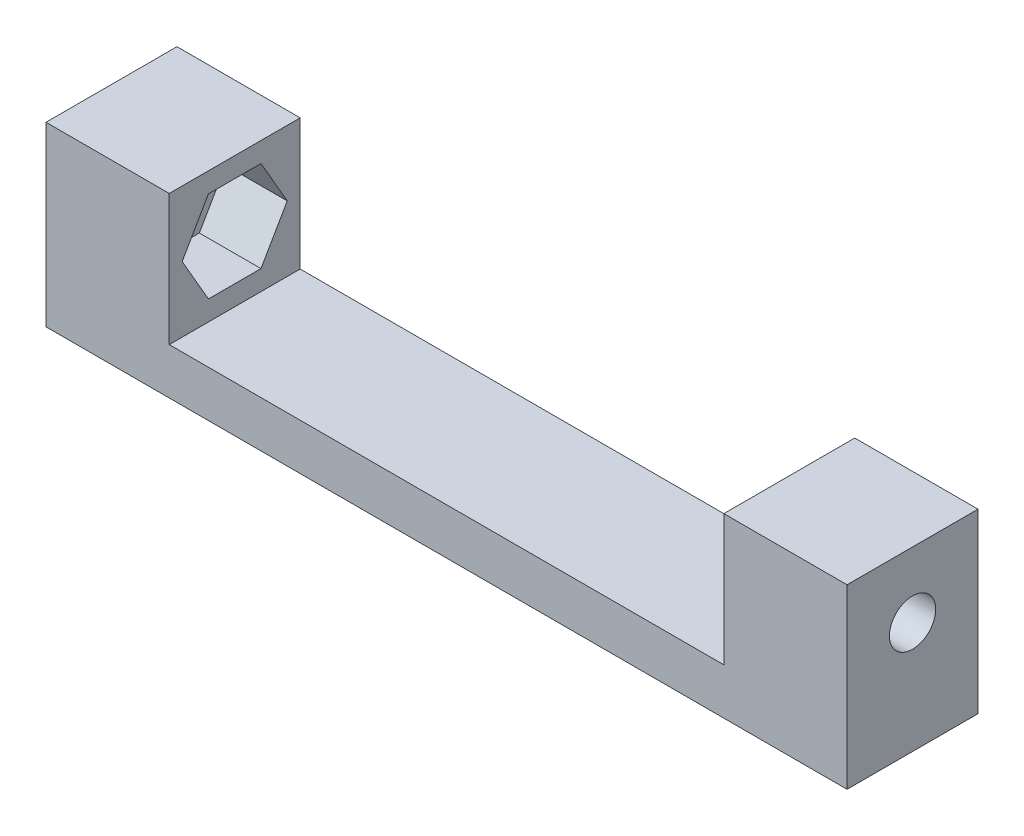
ISO-10303-21;
HEADER;
FILE_DESCRIPTION(('STEP AP214'),'2;1');
FILE_NAME('part.step','',(''),(''),'','','');
FILE_SCHEMA(('AUTOMOTIVE_DESIGN { 1 0 10303 214 1 1 1 1 }'));
ENDSEC;
DATA;
#1=APPLICATION_CONTEXT('core data for automotive mechanical design processes');
#2=APPLICATION_PROTOCOL_DEFINITION('international standard','automotive_design',2000,#1);
#3=PRODUCT_CONTEXT('',#1,'mechanical');
#4=PRODUCT('Part','Part','',(#3));
#5=PRODUCT_RELATED_PRODUCT_CATEGORY('part','',(#4));
#6=PRODUCT_DEFINITION_FORMATION('','',#4);
#7=PRODUCT_DEFINITION_CONTEXT('part definition',#1,'design');
#8=PRODUCT_DEFINITION('design','',#6,#7);
#9=PRODUCT_DEFINITION_SHAPE('','',#8);
#10=(LENGTH_UNIT() NAMED_UNIT(*) SI_UNIT(.MILLI.,.METRE.));
#11=(NAMED_UNIT(*) PLANE_ANGLE_UNIT() SI_UNIT($,.RADIAN.));
#12=(NAMED_UNIT(*) SI_UNIT($,.STERADIAN.) SOLID_ANGLE_UNIT());
#13=UNCERTAINTY_MEASURE_WITH_UNIT(LENGTH_MEASURE(1.E-05),#10,'distance_accuracy_value','');
#14=(GEOMETRIC_REPRESENTATION_CONTEXT(3) GLOBAL_UNCERTAINTY_ASSIGNED_CONTEXT((#13)) GLOBAL_UNIT_ASSIGNED_CONTEXT((#10,
#11,#12)) REPRESENTATION_CONTEXT('',''));
#15=CARTESIAN_POINT('',(0.,0.,0.));
#16=DIRECTION('',(0.,0.,1.));
#17=DIRECTION('',(1.,0.,0.));
#18=AXIS2_PLACEMENT_3D('',#15,#16,#17);
#19=CARTESIAN_POINT('',(53.,0.,0.));
#20=DIRECTION('',(-1.,0.,0.));
#21=DIRECTION('',(0.,0.,1.));
#22=AXIS2_PLACEMENT_3D('',#19,#20,#21);
#23=CYLINDRICAL_SURFACE('',#22,1.5);
#24=CARTESIAN_POINT('',(50.,0.,0.));
#25=DIRECTION('',(-1.,0.,0.));
#26=DIRECTION('',(0.,0.,1.));
#27=AXIS2_PLACEMENT_3D('',#24,#25,#26);
#28=CIRCLE('',#27,1.5);
#29=CARTESIAN_POINT('',(50.,0.,1.5));
#30=VERTEX_POINT('',#29);
#31=EDGE_CURVE('E322',#30,#30,#28,.T.);
#32=ORIENTED_EDGE('',*,*,#31,.F.);
#33=EDGE_LOOP('',(#32));
#34=FACE_BOUND('',#33,.T.);
#35=CARTESIAN_POINT('',(46.,0.,0.));
#36=DIRECTION('',(-1.,0.,0.));
#37=DIRECTION('',(0.,0.,1.));
#38=AXIS2_PLACEMENT_3D('',#35,#36,#37);
#39=CIRCLE('',#38,1.5);
#40=CARTESIAN_POINT('',(46.,0.,1.5));
#41=VERTEX_POINT('',#40);
#42=EDGE_CURVE('E46',#41,#41,#39,.F.);
#43=ORIENTED_EDGE('',*,*,#42,.F.);
#44=EDGE_LOOP('',(#43));
#45=FACE_BOUND('',#44,.T.);
#46=ADVANCED_FACE('F42',(#34,#45),#23,.F.);
#47=CARTESIAN_POINT('',(-2.,0.,0.));
#48=DIRECTION('',(1.,0.,0.));
#49=DIRECTION('',(0.,0.,-1.));
#50=AXIS2_PLACEMENT_3D('',#47,#48,#49);
#51=CYLINDRICAL_SURFACE('',#50,1.5);
#52=CARTESIAN_POINT('',(-2.,0.,0.));
#53=DIRECTION('',(1.,0.,0.));
#54=DIRECTION('',(0.,0.,-1.));
#55=AXIS2_PLACEMENT_3D('',#52,#53,#54);
#56=CIRCLE('',#55,1.5);
#57=CARTESIAN_POINT('',(-2.,0.,-1.5));
#58=VERTEX_POINT('',#57);
#59=EDGE_CURVE('E372',#58,#58,#56,.T.);
#60=ORIENTED_EDGE('',*,*,#59,.F.);
#61=EDGE_LOOP('',(#60));
#62=FACE_BOUND('',#61,.T.);
#63=CARTESIAN_POINT('',(2.,0.,0.));
#64=DIRECTION('',(1.,0.,0.));
#65=DIRECTION('',(0.,0.,-1.));
#66=AXIS2_PLACEMENT_3D('',#63,#64,#65);
#67=CIRCLE('',#66,1.5);
#68=CARTESIAN_POINT('',(2.,0.,-1.5));
#69=VERTEX_POINT('',#68);
#70=EDGE_CURVE('E247',#69,#69,#67,.F.);
#71=ORIENTED_EDGE('',*,*,#70,.F.);
#72=EDGE_LOOP('',(#71));
#73=FACE_BOUND('',#72,.T.);
#74=ADVANCED_FACE('F415',(#62,#73),#51,.F.);
#75=CARTESIAN_POINT('',(0.,-4.25,0.));
#76=DIRECTION('',(0.,-1.,0.));
#77=DIRECTION('',(0.,0.,-1.));
#78=AXIS2_PLACEMENT_3D('',#75,#76,#77);
#79=PLANE('',#78);
#80=DIRECTION('',(-1.,0.,0.));
#81=VECTOR('',#80,1.);
#82=CARTESIAN_POINT('',(-2.,-4.25,4.25));
#83=LINE('',#82,#81);
#84=CARTESIAN_POINT('',(42.,-4.25,4.25));
#85=VERTEX_POINT('',#84);
#86=CARTESIAN_POINT('',(6.,-4.25,4.25));
#87=VERTEX_POINT('',#86);
#88=EDGE_CURVE('E65',#85,#87,#83,.T.);
#89=ORIENTED_EDGE('',*,*,#88,.F.);
#90=DIRECTION('',(0.,0.,1.));
#91=VECTOR('',#90,1.);
#92=CARTESIAN_POINT('',(42.,-4.25,-4.25));
#93=LINE('',#92,#91);
#94=CARTESIAN_POINT('',(42.,-4.25,-4.25));
#95=VERTEX_POINT('',#94);
#96=EDGE_CURVE('E60',#95,#85,#93,.T.);
#97=ORIENTED_EDGE('',*,*,#96,.F.);
#98=DIRECTION('',(1.,0.,0.));
#99=VECTOR('',#98,1.);
#100=CARTESIAN_POINT('',(-2.,-4.25,-4.25));
#101=LINE('',#100,#99);
#102=CARTESIAN_POINT('',(6.,-4.25,-4.25));
#103=VERTEX_POINT('',#102);
#104=EDGE_CURVE('E345',#103,#95,#101,.T.);
#105=ORIENTED_EDGE('',*,*,#104,.F.);
#106=DIRECTION('',(0.,0.,-1.));
#107=VECTOR('',#106,1.);
#108=CARTESIAN_POINT('',(6.,-4.25,4.25));
#109=LINE('',#108,#107);
#110=EDGE_CURVE('E311',#87,#103,#109,.T.);
#111=ORIENTED_EDGE('',*,*,#110,.F.);
#112=EDGE_LOOP('',(#89,#97,#105,#111));
#113=FACE_BOUND('',#112,.T.);
#114=ADVANCED_FACE('F417',(#113),#79,.F.);
#115=CARTESIAN_POINT('',(5.,-4.25,-4.25));
#116=DIRECTION('',(0.,0.,1.));
#117=DIRECTION('',(1.,0.,0.));
#118=AXIS2_PLACEMENT_3D('',#115,#116,#117);
#119=PLANE('',#118);
#120=DIRECTION('',(-1.,0.,0.));
#121=VECTOR('',#120,1.);
#122=CARTESIAN_POINT('',(5.,4.25,-4.25));
#123=LINE('',#122,#121);
#124=CARTESIAN_POINT('',(6.,4.25,-4.25));
#125=VERTEX_POINT('',#124);
#126=CARTESIAN_POINT('',(-2.,4.25,-4.25));
#127=VERTEX_POINT('',#126);
#128=EDGE_CURVE('E11',#125,#127,#123,.T.);
#129=ORIENTED_EDGE('',*,*,#128,.F.);
#130=DIRECTION('',(0.,1.,0.));
#131=VECTOR('',#130,1.);
#132=CARTESIAN_POINT('',(6.,4.25,-4.25));
#133=LINE('',#132,#131);
#134=EDGE_CURVE('E314',#103,#125,#133,.T.);
#135=ORIENTED_EDGE('',*,*,#134,.F.);
#136=ORIENTED_EDGE('',*,*,#104,.T.);
#137=DIRECTION('',(0.,-1.,0.));
#138=VECTOR('',#137,1.);
#139=CARTESIAN_POINT('',(42.,4.25,-4.25));
#140=LINE('',#139,#138);
#141=CARTESIAN_POINT('',(42.,4.25,-4.25));
#142=VERTEX_POINT('',#141);
#143=EDGE_CURVE('E269',#142,#95,#140,.T.);
#144=ORIENTED_EDGE('',*,*,#143,.F.);
#145=DIRECTION('',(1.,0.,0.));
#146=VECTOR('',#145,1.);
#147=CARTESIAN_POINT('',(50.,4.25,-4.25));
#148=LINE('',#147,#146);
#149=CARTESIAN_POINT('',(50.,4.25,-4.25));
#150=VERTEX_POINT('',#149);
#151=EDGE_CURVE('E337',#142,#150,#148,.T.);
#152=ORIENTED_EDGE('',*,*,#151,.T.);
#153=DIRECTION('',(0.,1.,0.));
#154=VECTOR('',#153,1.);
#155=CARTESIAN_POINT('',(50.,-7.25,-4.25));
#156=LINE('',#155,#154);
#157=CARTESIAN_POINT('',(50.,-7.25,-4.25));
#158=VERTEX_POINT('',#157);
#159=EDGE_CURVE('E369',#158,#150,#156,.T.);
#160=ORIENTED_EDGE('',*,*,#159,.F.);
#161=DIRECTION('',(1.,0.,0.));
#162=VECTOR('',#161,1.);
#163=CARTESIAN_POINT('',(-2.,-7.25,-4.25));
#164=LINE('',#163,#162);
#165=CARTESIAN_POINT('',(-2.,-7.25,-4.25));
#166=VERTEX_POINT('',#165);
#167=EDGE_CURVE('E352',#166,#158,#164,.T.);
#168=ORIENTED_EDGE('',*,*,#167,.F.);
#169=DIRECTION('',(0.,-1.,0.));
#170=VECTOR('',#169,1.);
#171=CARTESIAN_POINT('',(-2.,-4.25,-4.25));
#172=LINE('',#171,#170);
#173=EDGE_CURVE('E384',#127,#166,#172,.T.);
#174=ORIENTED_EDGE('',*,*,#173,.F.);
#175=EDGE_LOOP('',(#129,#135,#136,#144,#152,#160,#168,#174));
#176=FACE_BOUND('',#175,.T.);
#177=ADVANCED_FACE('F44',(#176),#119,.F.);
#178=CARTESIAN_POINT('',(5.,4.25,4.25));
#179=DIRECTION('',(0.,-1.,0.));
#180=DIRECTION('',(0.,0.,-1.));
#181=AXIS2_PLACEMENT_3D('',#178,#179,#180);
#182=PLANE('',#181);
#183=ORIENTED_EDGE('',*,*,#128,.T.);
#184=DIRECTION('',(0.,0.,-1.));
#185=VECTOR('',#184,1.);
#186=CARTESIAN_POINT('',(-2.,4.25,-4.25));
#187=LINE('',#186,#185);
#188=CARTESIAN_POINT('',(-2.,4.25,4.25));
#189=VERTEX_POINT('',#188);
#190=EDGE_CURVE('E380',#189,#127,#187,.T.);
#191=ORIENTED_EDGE('',*,*,#190,.F.);
#192=DIRECTION('',(-1.,0.,0.));
#193=VECTOR('',#192,1.);
#194=CARTESIAN_POINT('',(5.,4.25,4.25));
#195=LINE('',#194,#193);
#196=CARTESIAN_POINT('',(6.,4.25,4.25));
#197=VERTEX_POINT('',#196);
#198=EDGE_CURVE('E52',#197,#189,#195,.T.);
#199=ORIENTED_EDGE('',*,*,#198,.F.);
#200=DIRECTION('',(0.,0.,1.));
#201=VECTOR('',#200,1.);
#202=CARTESIAN_POINT('',(6.,4.25,4.25));
#203=LINE('',#202,#201);
#204=EDGE_CURVE('E318',#125,#197,#203,.T.);
#205=ORIENTED_EDGE('',*,*,#204,.F.);
#206=EDGE_LOOP('',(#183,#191,#199,#205));
#207=FACE_BOUND('',#206,.T.);
#208=ADVANCED_FACE('F463',(#207),#182,.F.);
#209=CARTESIAN_POINT('',(5.,-4.25,4.25));
#210=DIRECTION('',(0.,0.,-1.));
#211=DIRECTION('',(-1.,0.,0.));
#212=AXIS2_PLACEMENT_3D('',#209,#210,#211);
#213=PLANE('',#212);
#214=DIRECTION('',(0.,1.,0.));
#215=VECTOR('',#214,1.);
#216=CARTESIAN_POINT('',(42.,4.25,4.25));
#217=LINE('',#216,#215);
#218=CARTESIAN_POINT('',(42.,4.25,4.25));
#219=VERTEX_POINT('',#218);
#220=EDGE_CURVE('E275',#85,#219,#217,.T.);
#221=ORIENTED_EDGE('',*,*,#220,.F.);
#222=ORIENTED_EDGE('',*,*,#88,.T.);
#223=DIRECTION('',(0.,-1.,0.));
#224=VECTOR('',#223,1.);
#225=CARTESIAN_POINT('',(6.,4.25,4.25));
#226=LINE('',#225,#224);
#227=EDGE_CURVE('E307',#197,#87,#226,.T.);
#228=ORIENTED_EDGE('',*,*,#227,.F.);
#229=ORIENTED_EDGE('',*,*,#198,.T.);
#230=DIRECTION('',(0.,1.,0.));
#231=VECTOR('',#230,1.);
#232=CARTESIAN_POINT('',(-2.,-4.25,4.25));
#233=LINE('',#232,#231);
#234=CARTESIAN_POINT('',(-2.,-7.25,4.25));
#235=VERTEX_POINT('',#234);
#236=EDGE_CURVE('E376',#235,#189,#233,.T.);
#237=ORIENTED_EDGE('',*,*,#236,.F.);
#238=DIRECTION('',(-1.,0.,0.));
#239=VECTOR('',#238,1.);
#240=CARTESIAN_POINT('',(-2.,-7.25,4.25));
#241=LINE('',#240,#239);
#242=CARTESIAN_POINT('',(50.,-7.25,4.25));
#243=VERTEX_POINT('',#242);
#244=EDGE_CURVE('E358',#243,#235,#241,.T.);
#245=ORIENTED_EDGE('',*,*,#244,.F.);
#246=DIRECTION('',(0.,1.,0.));
#247=VECTOR('',#246,1.);
#248=CARTESIAN_POINT('',(50.,-7.25,4.25));
#249=LINE('',#248,#247);
#250=CARTESIAN_POINT('',(50.,4.25,4.25));
#251=VERTEX_POINT('',#250);
#252=EDGE_CURVE('E362',#243,#251,#249,.T.);
#253=ORIENTED_EDGE('',*,*,#252,.T.);
#254=DIRECTION('',(-1.,0.,0.));
#255=VECTOR('',#254,1.);
#256=CARTESIAN_POINT('',(50.,4.25,4.25));
#257=LINE('',#256,#255);
#258=EDGE_CURVE('E326',#251,#219,#257,.T.);
#259=ORIENTED_EDGE('',*,*,#258,.T.);
#260=EDGE_LOOP('',(#221,#222,#228,#229,#237,#245,#253,#259));
#261=FACE_BOUND('',#260,.T.);
#262=ADVANCED_FACE('F460',(#261),#213,.F.);
#263=CARTESIAN_POINT('',(5.,0.,-3.41));
#264=DIRECTION('',(0.,-0.5,0.866025403784439));
#265=DIRECTION('',(0.,-0.866025403784439,-0.5));
#266=AXIS2_PLACEMENT_3D('',#263,#264,#265);
#267=PLANE('',#266);
#268=DIRECTION('',(-1.,0.,0.));
#269=VECTOR('',#268,1.);
#270=CARTESIAN_POINT('',(5.,2.95314662690494,-1.705));
#271=LINE('',#270,#269);
#272=CARTESIAN_POINT('',(6.,2.95314662690494,-1.705));
#273=VERTEX_POINT('',#272);
#274=CARTESIAN_POINT('',(2.,2.95314662690494,-1.705));
#275=VERTEX_POINT('',#274);
#276=EDGE_CURVE('E402',#273,#275,#271,.T.);
#277=ORIENTED_EDGE('',*,*,#276,.T.);
#278=DIRECTION('',(0.,0.866025403784439,0.5));
#279=VECTOR('',#278,1.);
#280=CARTESIAN_POINT('',(2.,0.,-3.41));
#281=LINE('',#280,#279);
#282=CARTESIAN_POINT('',(2.,0.,-3.41));
#283=VERTEX_POINT('',#282);
#284=EDGE_CURVE('E231',#283,#275,#281,.T.);
#285=ORIENTED_EDGE('',*,*,#284,.F.);
#286=DIRECTION('',(-1.,0.,0.));
#287=VECTOR('',#286,1.);
#288=CARTESIAN_POINT('',(5.,0.,-3.41));
#289=LINE('',#288,#287);
#290=CARTESIAN_POINT('',(6.,0.,-3.41));
#291=VERTEX_POINT('',#290);
#292=EDGE_CURVE('E387',#291,#283,#289,.T.);
#293=ORIENTED_EDGE('',*,*,#292,.F.);
#294=DIRECTION('',(0.,0.866025403784439,0.5));
#295=VECTOR('',#294,1.);
#296=CARTESIAN_POINT('',(6.,0.,-3.41));
#297=LINE('',#296,#295);
#298=EDGE_CURVE('E287',#291,#273,#297,.T.);
#299=ORIENTED_EDGE('',*,*,#298,.T.);
#300=EDGE_LOOP('',(#277,#285,#293,#299));
#301=FACE_BOUND('',#300,.T.);
#302=ADVANCED_FACE('F456',(#301),#267,.T.);
#303=CARTESIAN_POINT('',(5.,2.95314662690494,-1.705));
#304=DIRECTION('',(0.,-1.,0.));
#305=DIRECTION('',(0.,0.,-1.));
#306=AXIS2_PLACEMENT_3D('',#303,#304,#305);
#307=PLANE('',#306);
#308=DIRECTION('',(-1.,0.,0.));
#309=VECTOR('',#308,1.);
#310=CARTESIAN_POINT('',(5.,2.95314662690494,1.705));
#311=LINE('',#310,#309);
#312=CARTESIAN_POINT('',(6.,2.95314662690494,1.705));
#313=VERTEX_POINT('',#312);
#314=CARTESIAN_POINT('',(2.,2.95314662690494,1.705));
#315=VERTEX_POINT('',#314);
#316=EDGE_CURVE('E399',#313,#315,#311,.T.);
#317=ORIENTED_EDGE('',*,*,#316,.T.);
#318=DIRECTION('',(0.,0.,1.));
#319=VECTOR('',#318,1.);
#320=CARTESIAN_POINT('',(2.,2.95314662690494,-1.705));
#321=LINE('',#320,#319);
#322=EDGE_CURVE('E235',#275,#315,#321,.T.);
#323=ORIENTED_EDGE('',*,*,#322,.F.);
#324=ORIENTED_EDGE('',*,*,#276,.F.);
#325=DIRECTION('',(0.,0.,1.));
#326=VECTOR('',#325,1.);
#327=CARTESIAN_POINT('',(6.,2.95314662690494,-1.705));
#328=LINE('',#327,#326);
#329=EDGE_CURVE('E291',#273,#313,#328,.T.);
#330=ORIENTED_EDGE('',*,*,#329,.T.);
#331=EDGE_LOOP('',(#317,#323,#324,#330));
#332=FACE_BOUND('',#331,.T.);
#333=ADVANCED_FACE('F452',(#332),#307,.T.);
#334=CARTESIAN_POINT('',(5.,2.95314662690494,1.705));
#335=DIRECTION('',(0.,-0.5,-0.866025403784439));
#336=DIRECTION('',(0.,0.866025403784439,-0.5));
#337=AXIS2_PLACEMENT_3D('',#334,#335,#336);
#338=PLANE('',#337);
#339=DIRECTION('',(-1.,0.,0.));
#340=VECTOR('',#339,1.);
#341=CARTESIAN_POINT('',(5.,0.,3.41));
#342=LINE('',#341,#340);
#343=CARTESIAN_POINT('',(6.,0.,3.41));
#344=VERTEX_POINT('',#343);
#345=CARTESIAN_POINT('',(2.,0.,3.41));
#346=VERTEX_POINT('',#345);
#347=EDGE_CURVE('E396',#344,#346,#342,.T.);
#348=ORIENTED_EDGE('',*,*,#347,.T.);
#349=DIRECTION('',(0.,-0.866025403784439,0.5));
#350=VECTOR('',#349,1.);
#351=CARTESIAN_POINT('',(2.,2.95314662690494,1.705));
#352=LINE('',#351,#350);
#353=EDGE_CURVE('E239',#315,#346,#352,.T.);
#354=ORIENTED_EDGE('',*,*,#353,.F.);
#355=ORIENTED_EDGE('',*,*,#316,.F.);
#356=DIRECTION('',(0.,-0.866025403784439,0.5));
#357=VECTOR('',#356,1.);
#358=CARTESIAN_POINT('',(6.,2.95314662690494,1.705));
#359=LINE('',#358,#357);
#360=EDGE_CURVE('E295',#313,#344,#359,.T.);
#361=ORIENTED_EDGE('',*,*,#360,.T.);
#362=EDGE_LOOP('',(#348,#354,#355,#361));
#363=FACE_BOUND('',#362,.T.);
#364=ADVANCED_FACE('F448',(#363),#338,.T.);
#365=CARTESIAN_POINT('',(5.,0.,3.41));
#366=DIRECTION('',(0.,0.5,-0.866025403784439));
#367=DIRECTION('',(0.,0.866025403784439,0.5));
#368=AXIS2_PLACEMENT_3D('',#365,#366,#367);
#369=PLANE('',#368);
#370=DIRECTION('',(-1.,0.,0.));
#371=VECTOR('',#370,1.);
#372=CARTESIAN_POINT('',(5.,-2.95314662690494,1.705));
#373=LINE('',#372,#371);
#374=CARTESIAN_POINT('',(6.,-2.95314662690494,1.705));
#375=VERTEX_POINT('',#374);
#376=CARTESIAN_POINT('',(2.,-2.95314662690494,1.705));
#377=VERTEX_POINT('',#376);
#378=EDGE_CURVE('E393',#375,#377,#373,.T.);
#379=ORIENTED_EDGE('',*,*,#378,.T.);
#380=DIRECTION('',(0.,-0.866025403784438,-0.5));
#381=VECTOR('',#380,1.);
#382=CARTESIAN_POINT('',(2.,0.,3.41));
#383=LINE('',#382,#381);
#384=EDGE_CURVE('E243',#346,#377,#383,.T.);
#385=ORIENTED_EDGE('',*,*,#384,.F.);
#386=ORIENTED_EDGE('',*,*,#347,.F.);
#387=DIRECTION('',(0.,-0.866025403784438,-0.5));
#388=VECTOR('',#387,1.);
#389=CARTESIAN_POINT('',(6.,0.,3.41));
#390=LINE('',#389,#388);
#391=EDGE_CURVE('E299',#344,#375,#390,.T.);
#392=ORIENTED_EDGE('',*,*,#391,.T.);
#393=EDGE_LOOP('',(#379,#385,#386,#392));
#394=FACE_BOUND('',#393,.T.);
#395=ADVANCED_FACE('F444',(#394),#369,.T.);
#396=CARTESIAN_POINT('',(5.,-2.95314662690494,1.705));
#397=DIRECTION('',(0.,1.,0.));
#398=DIRECTION('',(0.,0.,1.));
#399=AXIS2_PLACEMENT_3D('',#396,#397,#398);
#400=PLANE('',#399);
#401=DIRECTION('',(-1.,0.,0.));
#402=VECTOR('',#401,1.);
#403=CARTESIAN_POINT('',(5.,-2.95314662690494,-1.705));
#404=LINE('',#403,#402);
#405=CARTESIAN_POINT('',(6.,-2.95314662690494,-1.705));
#406=VERTEX_POINT('',#405);
#407=CARTESIAN_POINT('',(2.,-2.95314662690494,-1.705));
#408=VERTEX_POINT('',#407);
#409=EDGE_CURVE('E390',#406,#408,#404,.T.);
#410=ORIENTED_EDGE('',*,*,#409,.T.);
#411=DIRECTION('',(0.,0.,-1.));
#412=VECTOR('',#411,1.);
#413=CARTESIAN_POINT('',(2.,-2.95314662690494,1.705));
#414=LINE('',#413,#412);
#415=EDGE_CURVE('E223',#377,#408,#414,.T.);
#416=ORIENTED_EDGE('',*,*,#415,.F.);
#417=ORIENTED_EDGE('',*,*,#378,.F.);
#418=DIRECTION('',(0.,0.,-1.));
#419=VECTOR('',#418,1.);
#420=CARTESIAN_POINT('',(6.,-2.95314662690494,1.705));
#421=LINE('',#420,#419);
#422=EDGE_CURVE('E303',#375,#406,#421,.T.);
#423=ORIENTED_EDGE('',*,*,#422,.T.);
#424=EDGE_LOOP('',(#410,#416,#417,#423));
#425=FACE_BOUND('',#424,.T.);
#426=ADVANCED_FACE('F440',(#425),#400,.T.);
#427=CARTESIAN_POINT('',(5.,-2.95314662690494,-1.705));
#428=DIRECTION('',(0.,0.5,0.866025403784439));
#429=DIRECTION('',(0.,-0.866025403784439,0.5));
#430=AXIS2_PLACEMENT_3D('',#427,#428,#429);
#431=PLANE('',#430);
#432=ORIENTED_EDGE('',*,*,#292,.T.);
#433=DIRECTION('',(0.,0.866025403784439,-0.5));
#434=VECTOR('',#433,1.);
#435=CARTESIAN_POINT('',(2.,-2.95314662690494,-1.705));
#436=LINE('',#435,#434);
#437=EDGE_CURVE('E227',#408,#283,#436,.T.);
#438=ORIENTED_EDGE('',*,*,#437,.F.);
#439=ORIENTED_EDGE('',*,*,#409,.F.);
#440=DIRECTION('',(0.,0.866025403784439,-0.5));
#441=VECTOR('',#440,1.);
#442=CARTESIAN_POINT('',(6.,-2.95314662690494,-1.705));
#443=LINE('',#442,#441);
#444=EDGE_CURVE('E283',#406,#291,#443,.T.);
#445=ORIENTED_EDGE('',*,*,#444,.T.);
#446=EDGE_LOOP('',(#432,#438,#439,#445));
#447=FACE_BOUND('',#446,.T.);
#448=ADVANCED_FACE('F436',(#447),#431,.T.);
#449=CARTESIAN_POINT('',(-2.,0.,0.));
#450=DIRECTION('',(1.,0.,0.));
#451=DIRECTION('',(0.,0.,-1.));
#452=AXIS2_PLACEMENT_3D('',#449,#450,#451);
#453=PLANE('',#452);
#454=ORIENTED_EDGE('',*,*,#59,.T.);
#455=EDGE_LOOP('',(#454));
#456=FACE_BOUND('',#455,.T.);
#457=ORIENTED_EDGE('',*,*,#236,.T.);
#458=ORIENTED_EDGE('',*,*,#190,.T.);
#459=ORIENTED_EDGE('',*,*,#173,.T.);
#460=DIRECTION('',(0.,0.,-1.));
#461=VECTOR('',#460,1.);
#462=CARTESIAN_POINT('',(-2.,-7.25,4.25));
#463=LINE('',#462,#461);
#464=EDGE_CURVE('E348',#235,#166,#463,.T.);
#465=ORIENTED_EDGE('',*,*,#464,.F.);
#466=EDGE_LOOP('',(#457,#458,#459,#465));
#467=FACE_BOUND('',#466,.T.);
#468=ADVANCED_FACE('F433',(#456,#467),#453,.F.);
#469=CARTESIAN_POINT('',(50.,-7.25,4.25));
#470=DIRECTION('',(-1.,0.,0.));
#471=DIRECTION('',(0.,0.,1.));
#472=AXIS2_PLACEMENT_3D('',#469,#470,#471);
#473=PLANE('',#472);
#474=ORIENTED_EDGE('',*,*,#31,.T.);
#475=EDGE_LOOP('',(#474));
#476=FACE_BOUND('',#475,.T.);
#477=ORIENTED_EDGE('',*,*,#159,.T.);
#478=DIRECTION('',(0.,0.,1.));
#479=VECTOR('',#478,1.);
#480=CARTESIAN_POINT('',(50.,4.25,-4.25));
#481=LINE('',#480,#479);
#482=EDGE_CURVE('E341',#150,#251,#481,.T.);
#483=ORIENTED_EDGE('',*,*,#482,.T.);
#484=ORIENTED_EDGE('',*,*,#252,.F.);
#485=DIRECTION('',(0.,0.,1.));
#486=VECTOR('',#485,1.);
#487=CARTESIAN_POINT('',(50.,-7.25,4.25));
#488=LINE('',#487,#486);
#489=EDGE_CURVE('E355',#158,#243,#488,.T.);
#490=ORIENTED_EDGE('',*,*,#489,.F.);
#491=EDGE_LOOP('',(#477,#483,#484,#490));
#492=FACE_BOUND('',#491,.T.);
#493=ADVANCED_FACE('F432',(#476,#492),#473,.F.);
#494=CARTESIAN_POINT('',(0.,-7.25,0.));
#495=DIRECTION('',(0.,-1.,0.));
#496=DIRECTION('',(0.,0.,-1.));
#497=AXIS2_PLACEMENT_3D('',#494,#495,#496);
#498=PLANE('',#497);
#499=ORIENTED_EDGE('',*,*,#464,.T.);
#500=ORIENTED_EDGE('',*,*,#167,.T.);
#501=ORIENTED_EDGE('',*,*,#489,.T.);
#502=ORIENTED_EDGE('',*,*,#244,.T.);
#503=EDGE_LOOP('',(#499,#500,#501,#502));
#504=FACE_BOUND('',#503,.T.);
#505=ADVANCED_FACE('F481',(#504),#498,.T.);
#506=CARTESIAN_POINT('',(5.,4.25,4.25));
#507=DIRECTION('',(0.,-1.,0.));
#508=DIRECTION('',(0.,0.,-1.));
#509=AXIS2_PLACEMENT_3D('',#506,#507,#508);
#510=PLANE('',#509);
#511=ORIENTED_EDGE('',*,*,#151,.F.);
#512=DIRECTION('',(0.,0.,-1.));
#513=VECTOR('',#512,1.);
#514=CARTESIAN_POINT('',(42.,4.25,-4.25));
#515=LINE('',#514,#513);
#516=EDGE_CURVE('E279',#219,#142,#515,.T.);
#517=ORIENTED_EDGE('',*,*,#516,.F.);
#518=ORIENTED_EDGE('',*,*,#258,.F.);
#519=ORIENTED_EDGE('',*,*,#482,.F.);
#520=EDGE_LOOP('',(#511,#517,#518,#519));
#521=FACE_BOUND('',#520,.T.);
#522=ADVANCED_FACE('F496',(#521),#510,.F.);
#523=CARTESIAN_POINT('',(48.,-2.95314662690494,1.705));
#524=DIRECTION('',(0.,-0.5,0.866025403784439));
#525=DIRECTION('',(0.,-0.866025403784439,-0.5));
#526=AXIS2_PLACEMENT_3D('',#523,#524,#525);
#527=PLANE('',#526);
#528=DIRECTION('',(-1.,0.,0.));
#529=VECTOR('',#528,1.);
#530=CARTESIAN_POINT('',(48.,0.,3.41));
#531=LINE('',#530,#529);
#532=CARTESIAN_POINT('',(46.,0.,3.41));
#533=VERTEX_POINT('',#532);
#534=CARTESIAN_POINT('',(42.,0.,3.41));
#535=VERTEX_POINT('',#534);
#536=EDGE_CURVE('E193',#533,#535,#531,.T.);
#537=ORIENTED_EDGE('',*,*,#536,.F.);
#538=DIRECTION('',(0.,0.866025403784439,0.5));
#539=VECTOR('',#538,1.);
#540=CARTESIAN_POINT('',(46.,-2.95314662690494,1.705));
#541=LINE('',#540,#539);
#542=CARTESIAN_POINT('',(46.,-2.95314662690494,1.705));
#543=VERTEX_POINT('',#542);
#544=EDGE_CURVE('E208',#543,#533,#541,.T.);
#545=ORIENTED_EDGE('',*,*,#544,.F.);
#546=DIRECTION('',(-1.,0.,0.));
#547=VECTOR('',#546,1.);
#548=CARTESIAN_POINT('',(48.,-2.95314662690494,1.705));
#549=LINE('',#548,#547);
#550=CARTESIAN_POINT('',(42.,-2.95314662690494,1.705));
#551=VERTEX_POINT('',#550);
#552=EDGE_CURVE('E323',#543,#551,#549,.T.);
#553=ORIENTED_EDGE('',*,*,#552,.T.);
#554=DIRECTION('',(0.,0.866025403784439,0.5));
#555=VECTOR('',#554,1.);
#556=CARTESIAN_POINT('',(42.,-2.95314662690494,1.705));
#557=LINE('',#556,#555);
#558=EDGE_CURVE('E260',#551,#535,#557,.T.);
#559=ORIENTED_EDGE('',*,*,#558,.T.);
#560=EDGE_LOOP('',(#537,#545,#553,#559));
#561=FACE_BOUND('',#560,.T.);
#562=ADVANCED_FACE('F526',(#561),#527,.F.);
#563=CARTESIAN_POINT('',(48.,-2.95314662690494,-1.705));
#564=DIRECTION('',(0.,-1.,0.));
#565=DIRECTION('',(0.,0.,-1.));
#566=AXIS2_PLACEMENT_3D('',#563,#564,#565);
#567=PLANE('',#566);
#568=ORIENTED_EDGE('',*,*,#552,.F.);
#569=DIRECTION('',(0.,0.,1.));
#570=VECTOR('',#569,1.);
#571=CARTESIAN_POINT('',(46.,-2.95314662690494,-1.705));
#572=LINE('',#571,#570);
#573=CARTESIAN_POINT('',(46.,-2.95314662690494,-1.705));
#574=VERTEX_POINT('',#573);
#575=EDGE_CURVE('E218',#574,#543,#572,.T.);
#576=ORIENTED_EDGE('',*,*,#575,.F.);
#577=DIRECTION('',(-1.,0.,0.));
#578=VECTOR('',#577,1.);
#579=CARTESIAN_POINT('',(48.,-2.95314662690494,-1.705));
#580=LINE('',#579,#578);
#581=CARTESIAN_POINT('',(42.,-2.95314662690494,-1.705));
#582=VERTEX_POINT('',#581);
#583=EDGE_CURVE('E327',#574,#582,#580,.T.);
#584=ORIENTED_EDGE('',*,*,#583,.T.);
#585=DIRECTION('',(0.,0.,1.));
#586=VECTOR('',#585,1.);
#587=CARTESIAN_POINT('',(42.,-2.95314662690494,-1.705));
#588=LINE('',#587,#586);
#589=EDGE_CURVE('E256',#582,#551,#588,.T.);
#590=ORIENTED_EDGE('',*,*,#589,.T.);
#591=EDGE_LOOP('',(#568,#576,#584,#590));
#592=FACE_BOUND('',#591,.T.);
#593=ADVANCED_FACE('F522',(#592),#567,.F.);
#594=CARTESIAN_POINT('',(48.,0.,-3.41));
#595=DIRECTION('',(0.,-0.5,-0.866025403784439));
#596=DIRECTION('',(0.,0.866025403784439,-0.5));
#597=AXIS2_PLACEMENT_3D('',#594,#595,#596);
#598=PLANE('',#597);
#599=ORIENTED_EDGE('',*,*,#583,.F.);
#600=DIRECTION('',(0.,-0.866025403784439,0.5));
#601=VECTOR('',#600,1.);
#602=CARTESIAN_POINT('',(46.,0.,-3.41));
#603=LINE('',#602,#601);
#604=CARTESIAN_POINT('',(46.,0.,-3.41));
#605=VERTEX_POINT('',#604);
#606=EDGE_CURVE('E214',#605,#574,#603,.T.);
#607=ORIENTED_EDGE('',*,*,#606,.F.);
#608=DIRECTION('',(-1.,0.,0.));
#609=VECTOR('',#608,1.);
#610=CARTESIAN_POINT('',(48.,0.,-3.41));
#611=LINE('',#610,#609);
#612=CARTESIAN_POINT('',(42.,0.,-3.41));
#613=VERTEX_POINT('',#612);
#614=EDGE_CURVE('E330',#605,#613,#611,.T.);
#615=ORIENTED_EDGE('',*,*,#614,.T.);
#616=DIRECTION('',(0.,-0.866025403784439,0.5));
#617=VECTOR('',#616,1.);
#618=CARTESIAN_POINT('',(42.,0.,-3.41));
#619=LINE('',#618,#617);
#620=EDGE_CURVE('E252',#613,#582,#619,.T.);
#621=ORIENTED_EDGE('',*,*,#620,.T.);
#622=EDGE_LOOP('',(#599,#607,#615,#621));
#623=FACE_BOUND('',#622,.T.);
#624=ADVANCED_FACE('F525',(#623),#598,.F.);
#625=CARTESIAN_POINT('',(48.,2.95314662690494,-1.705));
#626=DIRECTION('',(0.,0.5,-0.866025403784439));
#627=DIRECTION('',(0.,0.866025403784439,0.5));
#628=AXIS2_PLACEMENT_3D('',#625,#626,#627);
#629=PLANE('',#628);
#630=ORIENTED_EDGE('',*,*,#614,.F.);
#631=DIRECTION('',(0.,-0.866025403784439,-0.5));
#632=VECTOR('',#631,1.);
#633=CARTESIAN_POINT('',(46.,2.95314662690494,-1.705));
#634=LINE('',#633,#632);
#635=CARTESIAN_POINT('',(46.,2.95314662690494,-1.705));
#636=VERTEX_POINT('',#635);
#637=EDGE_CURVE('E202',#636,#605,#634,.T.);
#638=ORIENTED_EDGE('',*,*,#637,.F.);
#639=DIRECTION('',(-1.,0.,0.));
#640=VECTOR('',#639,1.);
#641=CARTESIAN_POINT('',(48.,2.95314662690494,-1.705));
#642=LINE('',#641,#640);
#643=CARTESIAN_POINT('',(42.,2.95314662690494,-1.705));
#644=VERTEX_POINT('',#643);
#645=EDGE_CURVE('E192',#636,#644,#642,.T.);
#646=ORIENTED_EDGE('',*,*,#645,.T.);
#647=DIRECTION('',(0.,-0.866025403784439,-0.5));
#648=VECTOR('',#647,1.);
#649=CARTESIAN_POINT('',(42.,2.95314662690494,-1.705));
#650=LINE('',#649,#648);
#651=EDGE_CURVE('E248',#644,#613,#650,.T.);
#652=ORIENTED_EDGE('',*,*,#651,.T.);
#653=EDGE_LOOP('',(#630,#638,#646,#652));
#654=FACE_BOUND('',#653,.T.);
#655=ADVANCED_FACE('F530',(#654),#629,.F.);
#656=CARTESIAN_POINT('',(48.,2.95314662690494,1.705));
#657=DIRECTION('',(0.,1.,0.));
#658=DIRECTION('',(0.,0.,1.));
#659=AXIS2_PLACEMENT_3D('',#656,#657,#658);
#660=PLANE('',#659);
#661=ORIENTED_EDGE('',*,*,#645,.F.);
#662=DIRECTION('',(0.,0.,-1.));
#663=VECTOR('',#662,1.);
#664=CARTESIAN_POINT('',(46.,2.95314662690494,1.705));
#665=LINE('',#664,#663);
#666=CARTESIAN_POINT('',(46.,2.95314662690494,1.705));
#667=VERTEX_POINT('',#666);
#668=EDGE_CURVE('E196',#667,#636,#665,.T.);
#669=ORIENTED_EDGE('',*,*,#668,.F.);
#670=DIRECTION('',(-1.,0.,0.));
#671=VECTOR('',#670,1.);
#672=CARTESIAN_POINT('',(48.,2.95314662690494,1.705));
#673=LINE('',#672,#671);
#674=CARTESIAN_POINT('',(42.,2.95314662690494,1.705));
#675=VERTEX_POINT('',#674);
#676=EDGE_CURVE('E180',#667,#675,#673,.T.);
#677=ORIENTED_EDGE('',*,*,#676,.T.);
#678=DIRECTION('',(0.,0.,-1.));
#679=VECTOR('',#678,1.);
#680=CARTESIAN_POINT('',(42.,2.95314662690494,1.705));
#681=LINE('',#680,#679);
#682=EDGE_CURVE('E266',#675,#644,#681,.T.);
#683=ORIENTED_EDGE('',*,*,#682,.T.);
#684=EDGE_LOOP('',(#661,#669,#677,#683));
#685=FACE_BOUND('',#684,.T.);
#686=ADVANCED_FACE('F197',(#685),#660,.F.);
#687=CARTESIAN_POINT('',(48.,0.,3.41));
#688=DIRECTION('',(0.,0.5,0.866025403784439));
#689=DIRECTION('',(0.,-0.866025403784439,0.5));
#690=AXIS2_PLACEMENT_3D('',#687,#688,#689);
#691=PLANE('',#690);
#692=ORIENTED_EDGE('',*,*,#676,.F.);
#693=DIRECTION('',(0.,0.866025403784439,-0.5));
#694=VECTOR('',#693,1.);
#695=CARTESIAN_POINT('',(46.,0.,3.41));
#696=LINE('',#695,#694);
#697=EDGE_CURVE('E184',#533,#667,#696,.T.);
#698=ORIENTED_EDGE('',*,*,#697,.F.);
#699=ORIENTED_EDGE('',*,*,#536,.T.);
#700=DIRECTION('',(0.,0.866025403784439,-0.5));
#701=VECTOR('',#700,1.);
#702=CARTESIAN_POINT('',(42.,0.,3.41));
#703=LINE('',#702,#701);
#704=EDGE_CURVE('E187',#535,#675,#703,.T.);
#705=ORIENTED_EDGE('',*,*,#704,.T.);
#706=EDGE_LOOP('',(#692,#698,#699,#705));
#707=FACE_BOUND('',#706,.T.);
#708=ADVANCED_FACE('F182',(#707),#691,.F.);
#709=CARTESIAN_POINT('',(6.,0.,0.));
#710=DIRECTION('',(1.,0.,0.));
#711=DIRECTION('',(0.,0.,-1.));
#712=AXIS2_PLACEMENT_3D('',#709,#710,#711);
#713=PLANE('',#712);
#714=ORIENTED_EDGE('',*,*,#227,.T.);
#715=ORIENTED_EDGE('',*,*,#110,.T.);
#716=ORIENTED_EDGE('',*,*,#134,.T.);
#717=ORIENTED_EDGE('',*,*,#204,.T.);
#718=EDGE_LOOP('',(#714,#715,#716,#717));
#719=FACE_BOUND('',#718,.T.);
#720=ORIENTED_EDGE('',*,*,#298,.F.);
#721=ORIENTED_EDGE('',*,*,#444,.F.);
#722=ORIENTED_EDGE('',*,*,#422,.F.);
#723=ORIENTED_EDGE('',*,*,#391,.F.);
#724=ORIENTED_EDGE('',*,*,#360,.F.);
#725=ORIENTED_EDGE('',*,*,#329,.F.);
#726=EDGE_LOOP('',(#720,#721,#722,#723,#724,#725));
#727=FACE_BOUND('',#726,.T.);
#728=ADVANCED_FACE('F488',(#719,#727),#713,.T.);
#729=CARTESIAN_POINT('',(42.,0.,0.));
#730=DIRECTION('',(-1.,0.,0.));
#731=DIRECTION('',(0.,0.,1.));
#732=AXIS2_PLACEMENT_3D('',#729,#730,#731);
#733=PLANE('',#732);
#734=ORIENTED_EDGE('',*,*,#143,.T.);
#735=ORIENTED_EDGE('',*,*,#96,.T.);
#736=ORIENTED_EDGE('',*,*,#220,.T.);
#737=ORIENTED_EDGE('',*,*,#516,.T.);
#738=EDGE_LOOP('',(#734,#735,#736,#737));
#739=FACE_BOUND('',#738,.T.);
#740=ORIENTED_EDGE('',*,*,#620,.F.);
#741=ORIENTED_EDGE('',*,*,#651,.F.);
#742=ORIENTED_EDGE('',*,*,#682,.F.);
#743=ORIENTED_EDGE('',*,*,#704,.F.);
#744=ORIENTED_EDGE('',*,*,#558,.F.);
#745=ORIENTED_EDGE('',*,*,#589,.F.);
#746=EDGE_LOOP('',(#740,#741,#742,#743,#744,#745));
#747=FACE_BOUND('',#746,.T.);
#748=ADVANCED_FACE('F492',(#739,#747),#733,.T.);
#749=CARTESIAN_POINT('',(2.,0.,0.));
#750=DIRECTION('',(1.,0.,0.));
#751=DIRECTION('',(0.,0.,-1.));
#752=AXIS2_PLACEMENT_3D('',#749,#750,#751);
#753=PLANE('',#752);
#754=ORIENTED_EDGE('',*,*,#415,.T.);
#755=ORIENTED_EDGE('',*,*,#437,.T.);
#756=ORIENTED_EDGE('',*,*,#284,.T.);
#757=ORIENTED_EDGE('',*,*,#322,.T.);
#758=ORIENTED_EDGE('',*,*,#353,.T.);
#759=ORIENTED_EDGE('',*,*,#384,.T.);
#760=EDGE_LOOP('',(#754,#755,#756,#757,#758,#759));
#761=FACE_BOUND('',#760,.T.);
#762=ORIENTED_EDGE('',*,*,#70,.T.);
#763=EDGE_LOOP('',(#762));
#764=FACE_BOUND('',#763,.T.);
#765=ADVANCED_FACE('F413',(#761,#764),#753,.T.);
#766=CARTESIAN_POINT('',(46.,0.,0.));
#767=DIRECTION('',(-1.,0.,0.));
#768=DIRECTION('',(0.,0.,1.));
#769=AXIS2_PLACEMENT_3D('',#766,#767,#768);
#770=PLANE('',#769);
#771=ORIENTED_EDGE('',*,*,#697,.T.);
#772=ORIENTED_EDGE('',*,*,#668,.T.);
#773=ORIENTED_EDGE('',*,*,#637,.T.);
#774=ORIENTED_EDGE('',*,*,#606,.T.);
#775=ORIENTED_EDGE('',*,*,#575,.T.);
#776=ORIENTED_EDGE('',*,*,#544,.T.);
#777=EDGE_LOOP('',(#771,#772,#773,#774,#775,#776));
#778=FACE_BOUND('',#777,.T.);
#779=ORIENTED_EDGE('',*,*,#42,.T.);
#780=EDGE_LOOP('',(#779));
#781=FACE_BOUND('',#780,.T.);
#782=ADVANCED_FACE('F204',(#778,#781),#770,.T.);
#783=CLOSED_SHELL('',(#46,#74,#114,#177,#208,#262,#302,#333,#364,#395,#426,#448,#468,#493,#505,
#522,#562,#593,#624,#655,#686,#708,#728,#748,#765,#782));
#784=MANIFOLD_SOLID_BREP('B2',#783);
#785=ADVANCED_BREP_SHAPE_REPRESENTATION('',(#18,#784),#14);
#786=SHAPE_DEFINITION_REPRESENTATION(#9,#785);
ENDSEC;
END-ISO-10303-21;
